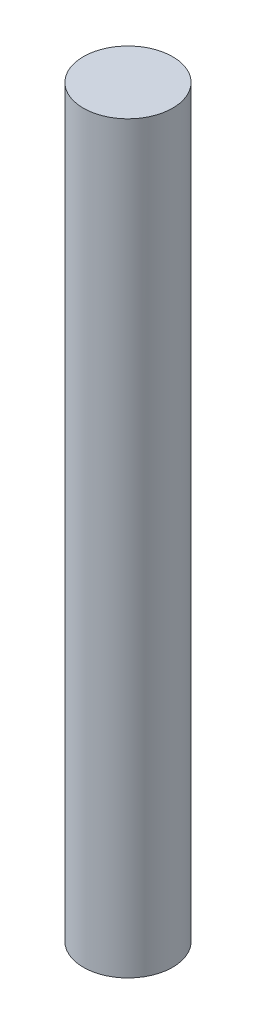
ISO-10303-21;
HEADER;
FILE_DESCRIPTION(('STEP AP214'),'2;1');
FILE_NAME('part.step','',(''),(''),'','','');
FILE_SCHEMA(('AUTOMOTIVE_DESIGN { 1 0 10303 214 1 1 1 1 }'));
ENDSEC;
DATA;
#1=APPLICATION_CONTEXT('core data for automotive mechanical design processes');
#2=APPLICATION_PROTOCOL_DEFINITION('international standard','automotive_design',2000,#1);
#3=PRODUCT_CONTEXT('',#1,'mechanical');
#4=PRODUCT('Part','Part','',(#3));
#5=PRODUCT_RELATED_PRODUCT_CATEGORY('part','',(#4));
#6=PRODUCT_DEFINITION_FORMATION('','',#4);
#7=PRODUCT_DEFINITION_CONTEXT('part definition',#1,'design');
#8=PRODUCT_DEFINITION('design','',#6,#7);
#9=PRODUCT_DEFINITION_SHAPE('','',#8);
#10=(LENGTH_UNIT() NAMED_UNIT(*) SI_UNIT(.MILLI.,.METRE.));
#11=(NAMED_UNIT(*) PLANE_ANGLE_UNIT() SI_UNIT($,.RADIAN.));
#12=(NAMED_UNIT(*) SI_UNIT($,.STERADIAN.) SOLID_ANGLE_UNIT());
#13=UNCERTAINTY_MEASURE_WITH_UNIT(LENGTH_MEASURE(1.E-05),#10,'distance_accuracy_value','');
#14=(GEOMETRIC_REPRESENTATION_CONTEXT(3) GLOBAL_UNCERTAINTY_ASSIGNED_CONTEXT((#13)) GLOBAL_UNIT_ASSIGNED_CONTEXT((#10,
#11,#12)) REPRESENTATION_CONTEXT('',''));
#15=CARTESIAN_POINT('',(0.,0.,0.));
#16=DIRECTION('',(0.,0.,1.));
#17=DIRECTION('',(1.,0.,0.));
#18=AXIS2_PLACEMENT_3D('',#15,#16,#17);
#19=CARTESIAN_POINT('',(0.,50.,0.));
#20=DIRECTION('',(0.,-1.,0.));
#21=DIRECTION('',(0.,0.,-1.));
#22=AXIS2_PLACEMENT_3D('',#19,#20,#21);
#23=CYLINDRICAL_SURFACE('',#22,3.);
#24=CARTESIAN_POINT('',(0.,50.,0.));
#25=DIRECTION('',(0.,1.,0.));
#26=DIRECTION('',(0.,0.,1.));
#27=AXIS2_PLACEMENT_3D('',#24,#25,#26);
#28=CIRCLE('',#27,3.);
#29=CARTESIAN_POINT('',(0.,50.,3.));
#30=VERTEX_POINT('',#29);
#31=EDGE_CURVE('E11',#30,#30,#28,.T.);
#32=ORIENTED_EDGE('',*,*,#31,.F.);
#33=EDGE_LOOP('',(#32));
#34=FACE_BOUND('',#33,.T.);
#35=CARTESIAN_POINT('',(0.,5.,0.));
#36=DIRECTION('',(0.,-1.,0.));
#37=DIRECTION('',(0.,0.,-1.));
#38=AXIS2_PLACEMENT_3D('',#35,#36,#37);
#39=CIRCLE('',#38,3.);
#40=CARTESIAN_POINT('',(-2.23606797749979,5.,-2.));
#41=VERTEX_POINT('',#40);
#42=CARTESIAN_POINT('',(2.23606797749979,5.,-2.));
#43=VERTEX_POINT('',#42);
#44=EDGE_CURVE('E75',#41,#43,#39,.T.);
#45=ORIENTED_EDGE('',*,*,#44,.F.);
#46=DIRECTION('',(0.,-1.,0.));
#47=VECTOR('',#46,1.);
#48=CARTESIAN_POINT('',(-2.23606797749979,5.,-2.));
#49=LINE('',#48,#47);
#50=CARTESIAN_POINT('',(-2.23606797749979,0.,-2.));
#51=VERTEX_POINT('',#50);
#52=EDGE_CURVE('E64',#41,#51,#49,.T.);
#53=ORIENTED_EDGE('',*,*,#52,.T.);
#54=CARTESIAN_POINT('',(0.,0.,0.));
#55=DIRECTION('',(0.,1.,0.));
#56=DIRECTION('',(0.,0.,1.));
#57=AXIS2_PLACEMENT_3D('',#54,#55,#56);
#58=CIRCLE('',#57,3.);
#59=CARTESIAN_POINT('',(2.23606797749979,0.,-2.));
#60=VERTEX_POINT('',#59);
#61=EDGE_CURVE('E46',#51,#60,#58,.T.);
#62=ORIENTED_EDGE('',*,*,#61,.T.);
#63=DIRECTION('',(0.,-1.,0.));
#64=VECTOR('',#63,1.);
#65=CARTESIAN_POINT('',(2.23606797749979,5.,-2.));
#66=LINE('',#65,#64);
#67=EDGE_CURVE('E58',#43,#60,#66,.T.);
#68=ORIENTED_EDGE('',*,*,#67,.F.);
#69=EDGE_LOOP('',(#45,#53,#62,#68));
#70=FACE_BOUND('',#69,.T.);
#71=ADVANCED_FACE('F43',(#34,#70),#23,.T.);
#72=CARTESIAN_POINT('',(0.,50.,0.));
#73=DIRECTION('',(0.,1.,0.));
#74=DIRECTION('',(0.,0.,1.));
#75=AXIS2_PLACEMENT_3D('',#72,#73,#74);
#76=PLANE('',#75);
#77=ORIENTED_EDGE('',*,*,#31,.T.);
#78=EDGE_LOOP('',(#77));
#79=FACE_BOUND('',#78,.T.);
#80=ADVANCED_FACE('F99',(#79),#76,.T.);
#81=CARTESIAN_POINT('',(0.,0.,0.));
#82=DIRECTION('',(0.,1.,0.));
#83=DIRECTION('',(0.,0.,1.));
#84=AXIS2_PLACEMENT_3D('',#81,#82,#83);
#85=PLANE('',#84);
#86=ORIENTED_EDGE('',*,*,#61,.F.);
#87=DIRECTION('',(-1.,0.,0.));
#88=VECTOR('',#87,1.);
#89=CARTESIAN_POINT('',(-2.23606797749979,0.,-2.));
#90=LINE('',#89,#88);
#91=EDGE_CURVE('E69',#60,#51,#90,.T.);
#92=ORIENTED_EDGE('',*,*,#91,.F.);
#93=EDGE_LOOP('',(#86,#92));
#94=FACE_BOUND('',#93,.T.);
#95=ADVANCED_FACE('F81',(#94),#85,.F.);
#96=CARTESIAN_POINT('',(-2.23606797749979,5.,-2.));
#97=DIRECTION('',(0.,0.,1.));
#98=DIRECTION('',(1.,0.,0.));
#99=AXIS2_PLACEMENT_3D('',#96,#97,#98);
#100=PLANE('',#99);
#101=ORIENTED_EDGE('',*,*,#91,.T.);
#102=ORIENTED_EDGE('',*,*,#52,.F.);
#103=DIRECTION('',(-1.,0.,0.));
#104=VECTOR('',#103,1.);
#105=CARTESIAN_POINT('',(-2.23606797749979,5.,-2.));
#106=LINE('',#105,#104);
#107=EDGE_CURVE('E85',#43,#41,#106,.T.);
#108=ORIENTED_EDGE('',*,*,#107,.F.);
#109=ORIENTED_EDGE('',*,*,#67,.T.);
#110=EDGE_LOOP('',(#101,#102,#108,#109));
#111=FACE_BOUND('',#110,.T.);
#112=ADVANCED_FACE('F70',(#111),#100,.F.);
#113=CARTESIAN_POINT('',(0.,5.,0.));
#114=DIRECTION('',(0.,-1.,0.));
#115=DIRECTION('',(0.,0.,-1.));
#116=AXIS2_PLACEMENT_3D('',#113,#114,#115);
#117=PLANE('',#116);
#118=ORIENTED_EDGE('',*,*,#44,.T.);
#119=ORIENTED_EDGE('',*,*,#107,.T.);
#120=EDGE_LOOP('',(#118,#119));
#121=FACE_BOUND('',#120,.T.);
#122=ADVANCED_FACE('F91',(#121),#117,.T.);
#123=CLOSED_SHELL('',(#71,#80,#95,#112,#122));
#124=MANIFOLD_SOLID_BREP('B2',#123);
#125=ADVANCED_BREP_SHAPE_REPRESENTATION('',(#18,#124),#14);
#126=SHAPE_DEFINITION_REPRESENTATION(#9,#125);
ENDSEC;
END-ISO-10303-21;
